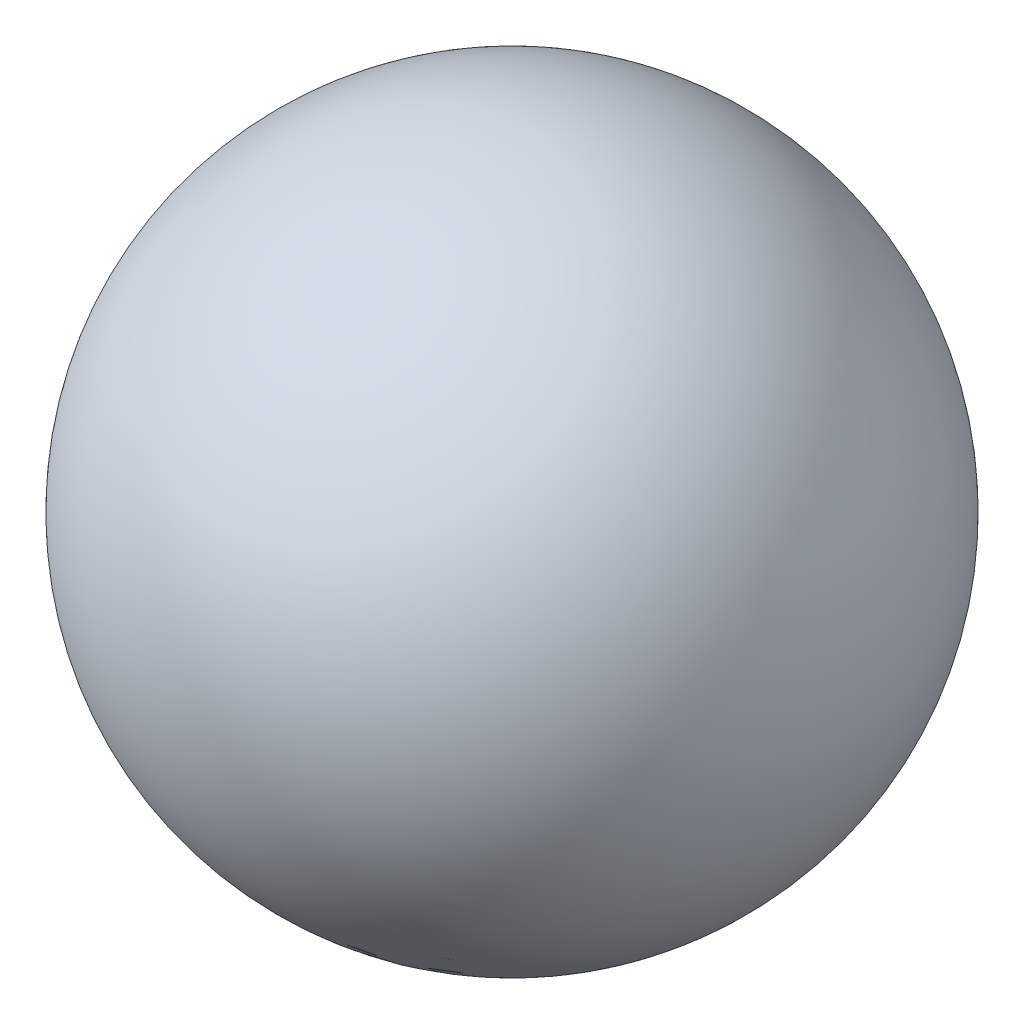
ISO-10303-21;
HEADER;
FILE_DESCRIPTION(('STEP AP214'),'2;1');
FILE_NAME('part.step','',(''),(''),'','','');
FILE_SCHEMA(('AUTOMOTIVE_DESIGN { 1 0 10303 214 1 1 1 1 }'));
ENDSEC;
DATA;
#1=APPLICATION_CONTEXT('core data for automotive mechanical design processes');
#2=APPLICATION_PROTOCOL_DEFINITION('international standard','automotive_design',2000,#1);
#3=PRODUCT_CONTEXT('',#1,'mechanical');
#4=PRODUCT('Part','Part','',(#3));
#5=PRODUCT_RELATED_PRODUCT_CATEGORY('part','',(#4));
#6=PRODUCT_DEFINITION_FORMATION('','',#4);
#7=PRODUCT_DEFINITION_CONTEXT('part definition',#1,'design');
#8=PRODUCT_DEFINITION('design','',#6,#7);
#9=PRODUCT_DEFINITION_SHAPE('','',#8);
#10=(LENGTH_UNIT() NAMED_UNIT(*) SI_UNIT(.MILLI.,.METRE.));
#11=(NAMED_UNIT(*) PLANE_ANGLE_UNIT() SI_UNIT($,.RADIAN.));
#12=(NAMED_UNIT(*) SI_UNIT($,.STERADIAN.) SOLID_ANGLE_UNIT());
#13=UNCERTAINTY_MEASURE_WITH_UNIT(LENGTH_MEASURE(1.E-05),#10,'distance_accuracy_value','');
#14=(GEOMETRIC_REPRESENTATION_CONTEXT(3) GLOBAL_UNCERTAINTY_ASSIGNED_CONTEXT((#13)) GLOBAL_UNIT_ASSIGNED_CONTEXT((#10,
#11,#12)) REPRESENTATION_CONTEXT('',''));
#15=CARTESIAN_POINT('',(0.,0.,0.));
#16=DIRECTION('',(0.,0.,1.));
#17=DIRECTION('',(1.,0.,0.));
#18=AXIS2_PLACEMENT_3D('',#15,#16,#17);
#19=CARTESIAN_POINT('',(0.,0.,0.));
#20=DIRECTION('',(0.60766732505853,0.513276703189821,0.606042447373779));
#21=DIRECTION('',(0.185418823792799,-0.833694543052991,0.520166577806533));
#22=AXIS2_PLACEMENT_3D('',#19,#20,#21);
#23=SPHERICAL_SURFACE('',#22,1.1905);
#24=CARTESIAN_POINT('',(0.723427950482179,0.611055915147483,0.721493533598483));
#25=VERTEX_POINT('',#24);
#26=VERTEX_LOOP('',#25);
#27=FACE_BOUND('',#26,.T.);
#28=CARTESIAN_POINT('',(-0.72342795048218,-0.611055915147481,-0.721493533598484));
#29=VERTEX_POINT('',#28);
#30=VERTEX_LOOP('',#29);
#31=FACE_BOUND('',#30,.T.);
#32=ADVANCED_FACE('F15',(#27,#31),#23,.T.);
#33=CLOSED_SHELL('',(#32));
#34=MANIFOLD_SOLID_BREP('B1',#33);
#35=ADVANCED_BREP_SHAPE_REPRESENTATION('',(#18,#34),#14);
#36=SHAPE_DEFINITION_REPRESENTATION(#9,#35);
ENDSEC;
END-ISO-10303-21;
